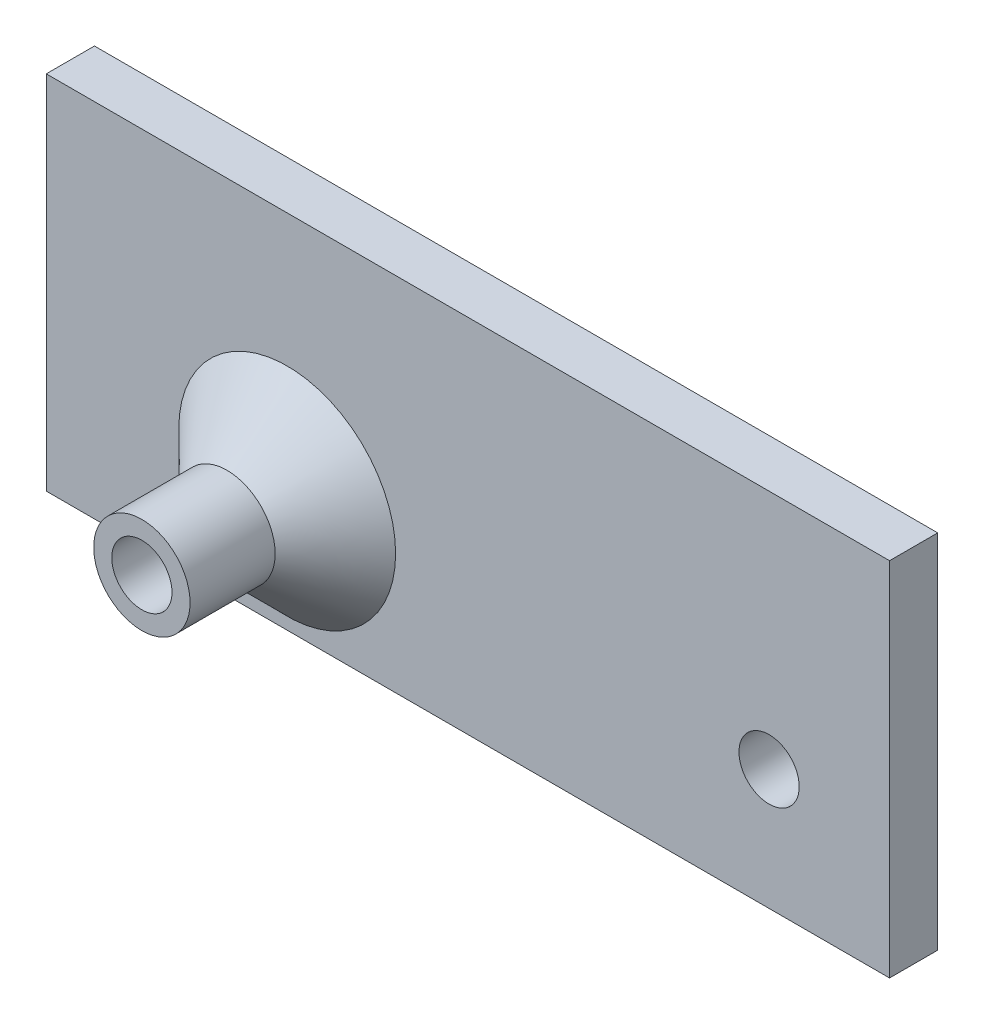
ISO-10303-21;
HEADER;
FILE_DESCRIPTION(('STEP AP214'),'2;1');
FILE_NAME('part.step','',(''),(''),'','','');
FILE_SCHEMA(('AUTOMOTIVE_DESIGN { 1 0 10303 214 1 1 1 1 }'));
ENDSEC;
DATA;
#1=APPLICATION_CONTEXT('core data for automotive mechanical design processes');
#2=APPLICATION_PROTOCOL_DEFINITION('international standard','automotive_design',2000,#1);
#3=PRODUCT_CONTEXT('',#1,'mechanical');
#4=PRODUCT('Part','Part','',(#3));
#5=PRODUCT_RELATED_PRODUCT_CATEGORY('part','',(#4));
#6=PRODUCT_DEFINITION_FORMATION('','',#4);
#7=PRODUCT_DEFINITION_CONTEXT('part definition',#1,'design');
#8=PRODUCT_DEFINITION('design','',#6,#7);
#9=PRODUCT_DEFINITION_SHAPE('','',#8);
#10=(LENGTH_UNIT() NAMED_UNIT(*) SI_UNIT(.MILLI.,.METRE.));
#11=(NAMED_UNIT(*) PLANE_ANGLE_UNIT() SI_UNIT($,.RADIAN.));
#12=(NAMED_UNIT(*) SI_UNIT($,.STERADIAN.) SOLID_ANGLE_UNIT());
#13=UNCERTAINTY_MEASURE_WITH_UNIT(LENGTH_MEASURE(1.E-05),#10,'distance_accuracy_value','');
#14=(GEOMETRIC_REPRESENTATION_CONTEXT(3) GLOBAL_UNCERTAINTY_ASSIGNED_CONTEXT((#13)) GLOBAL_UNIT_ASSIGNED_CONTEXT((#10,
#11,#12)) REPRESENTATION_CONTEXT('',''));
#15=CARTESIAN_POINT('',(0.,0.,0.));
#16=DIRECTION('',(0.,0.,1.));
#17=DIRECTION('',(1.,0.,0.));
#18=AXIS2_PLACEMENT_3D('',#15,#16,#17);
#19=CARTESIAN_POINT('',(50.,0.,4.));
#20=DIRECTION('',(1.,0.,0.));
#21=DIRECTION('',(0.,0.,-1.));
#22=AXIS2_PLACEMENT_3D('',#19,#20,#21);
#23=PLANE('',#22);
#24=DIRECTION('',(0.,-1.,0.));
#25=VECTOR('',#24,1.);
#26=CARTESIAN_POINT('',(50.,0.,0.));
#27=LINE('',#26,#25);
#28=CARTESIAN_POINT('',(50.,20.,0.));
#29=VERTEX_POINT('',#28);
#30=CARTESIAN_POINT('',(50.,-10.,0.));
#31=VERTEX_POINT('',#30);
#32=EDGE_CURVE('E127',#29,#31,#27,.T.);
#33=ORIENTED_EDGE('',*,*,#32,.F.);
#34=DIRECTION('',(0.,0.,-1.));
#35=VECTOR('',#34,1.);
#36=CARTESIAN_POINT('',(50.,20.,4.));
#37=LINE('',#36,#35);
#38=CARTESIAN_POINT('',(50.,20.,4.));
#39=VERTEX_POINT('',#38);
#40=EDGE_CURVE('E89',#39,#29,#37,.T.);
#41=ORIENTED_EDGE('',*,*,#40,.F.);
#42=DIRECTION('',(0.,-1.,0.));
#43=VECTOR('',#42,1.);
#44=CARTESIAN_POINT('',(50.,0.,4.));
#45=LINE('',#44,#43);
#46=CARTESIAN_POINT('',(50.,-10.,4.));
#47=VERTEX_POINT('',#46);
#48=EDGE_CURVE('E113',#39,#47,#45,.T.);
#49=ORIENTED_EDGE('',*,*,#48,.T.);
#50=DIRECTION('',(0.,0.,-1.));
#51=VECTOR('',#50,1.);
#52=CARTESIAN_POINT('',(50.,-10.,4.));
#53=LINE('',#52,#51);
#54=EDGE_CURVE('E86',#47,#31,#53,.T.);
#55=ORIENTED_EDGE('',*,*,#54,.T.);
#56=EDGE_LOOP('',(#33,#41,#49,#55));
#57=FACE_BOUND('',#56,.T.);
#58=ADVANCED_FACE('F43',(#57),#23,.T.);
#59=CARTESIAN_POINT('',(0.,20.,4.));
#60=DIRECTION('',(0.,1.,0.));
#61=DIRECTION('',(0.,0.,1.));
#62=AXIS2_PLACEMENT_3D('',#59,#60,#61);
#63=PLANE('',#62);
#64=DIRECTION('',(1.,0.,0.));
#65=VECTOR('',#64,1.);
#66=CARTESIAN_POINT('',(0.,20.,0.));
#67=LINE('',#66,#65);
#68=CARTESIAN_POINT('',(-20.,20.,0.));
#69=VERTEX_POINT('',#68);
#70=EDGE_CURVE('E100',#69,#29,#67,.T.);
#71=ORIENTED_EDGE('',*,*,#70,.F.);
#72=DIRECTION('',(0.,0.,-1.));
#73=VECTOR('',#72,1.);
#74=CARTESIAN_POINT('',(-20.,20.,4.));
#75=LINE('',#74,#73);
#76=CARTESIAN_POINT('',(-20.,20.,4.));
#77=VERTEX_POINT('',#76);
#78=EDGE_CURVE('E94',#77,#69,#75,.T.);
#79=ORIENTED_EDGE('',*,*,#78,.F.);
#80=DIRECTION('',(1.,0.,0.));
#81=VECTOR('',#80,1.);
#82=CARTESIAN_POINT('',(0.,20.,4.));
#83=LINE('',#82,#81);
#84=EDGE_CURVE('E98',#77,#39,#83,.T.);
#85=ORIENTED_EDGE('',*,*,#84,.T.);
#86=ORIENTED_EDGE('',*,*,#40,.T.);
#87=EDGE_LOOP('',(#71,#79,#85,#86));
#88=FACE_BOUND('',#87,.T.);
#89=ADVANCED_FACE('F96',(#88),#63,.T.);
#90=CARTESIAN_POINT('',(-20.,0.,4.));
#91=DIRECTION('',(1.,0.,0.));
#92=DIRECTION('',(0.,0.,-1.));
#93=AXIS2_PLACEMENT_3D('',#90,#91,#92);
#94=PLANE('',#93);
#95=DIRECTION('',(0.,-1.,0.));
#96=VECTOR('',#95,1.);
#97=CARTESIAN_POINT('',(-20.,0.,0.));
#98=LINE('',#97,#96);
#99=CARTESIAN_POINT('',(-20.,-10.,0.));
#100=VERTEX_POINT('',#99);
#101=EDGE_CURVE('E133',#69,#100,#98,.T.);
#102=ORIENTED_EDGE('',*,*,#101,.T.);
#103=DIRECTION('',(0.,0.,-1.));
#104=VECTOR('',#103,1.);
#105=CARTESIAN_POINT('',(-20.,-10.,4.));
#106=LINE('',#105,#104);
#107=CARTESIAN_POINT('',(-20.,-10.,4.));
#108=VERTEX_POINT('',#107);
#109=EDGE_CURVE('E104',#108,#100,#106,.T.);
#110=ORIENTED_EDGE('',*,*,#109,.F.);
#111=DIRECTION('',(0.,-1.,0.));
#112=VECTOR('',#111,1.);
#113=CARTESIAN_POINT('',(-20.,0.,4.));
#114=LINE('',#113,#112);
#115=EDGE_CURVE('E107',#77,#108,#114,.T.);
#116=ORIENTED_EDGE('',*,*,#115,.F.);
#117=ORIENTED_EDGE('',*,*,#78,.T.);
#118=EDGE_LOOP('',(#102,#110,#116,#117));
#119=FACE_BOUND('',#118,.T.);
#120=ADVANCED_FACE('F108',(#119),#94,.F.);
#121=CARTESIAN_POINT('',(0.,-10.,4.));
#122=DIRECTION('',(0.,1.,0.));
#123=DIRECTION('',(0.,0.,1.));
#124=AXIS2_PLACEMENT_3D('',#121,#122,#123);
#125=PLANE('',#124);
#126=DIRECTION('',(1.,0.,0.));
#127=VECTOR('',#126,1.);
#128=CARTESIAN_POINT('',(0.,-10.,0.));
#129=LINE('',#128,#127);
#130=EDGE_CURVE('E79',#100,#31,#129,.T.);
#131=ORIENTED_EDGE('',*,*,#130,.T.);
#132=ORIENTED_EDGE('',*,*,#54,.F.);
#133=DIRECTION('',(1.,0.,0.));
#134=VECTOR('',#133,1.);
#135=CARTESIAN_POINT('',(0.,-10.,4.));
#136=LINE('',#135,#134);
#137=EDGE_CURVE('E62',#108,#47,#136,.T.);
#138=ORIENTED_EDGE('',*,*,#137,.F.);
#139=ORIENTED_EDGE('',*,*,#109,.T.);
#140=EDGE_LOOP('',(#131,#132,#138,#139));
#141=FACE_BOUND('',#140,.T.);
#142=ADVANCED_FACE('F170',(#141),#125,.F.);
#143=CARTESIAN_POINT('',(40.,0.,4.));
#144=DIRECTION('',(0.,0.,-1.));
#145=DIRECTION('',(-1.,0.,0.));
#146=AXIS2_PLACEMENT_3D('',#143,#144,#145);
#147=CYLINDRICAL_SURFACE('',#146,2.50000000000001);
#148=CARTESIAN_POINT('',(40.,0.,4.));
#149=DIRECTION('',(0.,0.,1.));
#150=DIRECTION('',(1.,0.,0.));
#151=AXIS2_PLACEMENT_3D('',#148,#149,#150);
#152=CIRCLE('',#151,2.50000000000001);
#153=CARTESIAN_POINT('',(42.5,0.,4.));
#154=VERTEX_POINT('',#153);
#155=EDGE_CURVE('E123',#154,#154,#152,.T.);
#156=ORIENTED_EDGE('',*,*,#155,.T.);
#157=EDGE_LOOP('',(#156));
#158=FACE_BOUND('',#157,.T.);
#159=CARTESIAN_POINT('',(40.,0.,0.));
#160=DIRECTION('',(0.,0.,1.));
#161=DIRECTION('',(1.,0.,0.));
#162=AXIS2_PLACEMENT_3D('',#159,#160,#161);
#163=CIRCLE('',#162,2.50000000000001);
#164=CARTESIAN_POINT('',(42.5,0.,0.));
#165=VERTEX_POINT('',#164);
#166=EDGE_CURVE('E117',#165,#165,#163,.T.);
#167=ORIENTED_EDGE('',*,*,#166,.F.);
#168=EDGE_LOOP('',(#167));
#169=FACE_BOUND('',#168,.T.);
#170=ADVANCED_FACE('F173',(#158,#169),#147,.F.);
#171=CARTESIAN_POINT('',(0.,0.,4.));
#172=DIRECTION('',(0.,0.,1.));
#173=DIRECTION('',(1.,0.,0.));
#174=AXIS2_PLACEMENT_3D('',#171,#172,#173);
#175=PLANE('',#174);
#176=CARTESIAN_POINT('',(0.,0.,4.));
#177=DIRECTION('',(0.,0.,1.));
#178=DIRECTION('',(1.,0.,0.));
#179=AXIS2_PLACEMENT_3D('',#176,#177,#178);
#180=CIRCLE('',#179,8.99999999999998);
#181=CARTESIAN_POINT('',(8.99999999999998,0.,4.));
#182=VERTEX_POINT('',#181);
#183=EDGE_CURVE('E11',#182,#182,#180,.F.);
#184=ORIENTED_EDGE('',*,*,#183,.T.);
#185=EDGE_LOOP('',(#184));
#186=FACE_BOUND('',#185,.T.);
#187=ORIENTED_EDGE('',*,*,#48,.F.);
#188=ORIENTED_EDGE('',*,*,#84,.F.);
#189=ORIENTED_EDGE('',*,*,#115,.T.);
#190=ORIENTED_EDGE('',*,*,#137,.T.);
#191=EDGE_LOOP('',(#187,#188,#189,#190));
#192=FACE_BOUND('',#191,.T.);
#193=ORIENTED_EDGE('',*,*,#155,.F.);
#194=EDGE_LOOP('',(#193));
#195=FACE_BOUND('',#194,.T.);
#196=ADVANCED_FACE('F111',(#186,#192,#195),#175,.T.);
#197=CARTESIAN_POINT('',(0.,0.,0.));
#198=DIRECTION('',(0.,0.,1.));
#199=DIRECTION('',(1.,0.,0.));
#200=AXIS2_PLACEMENT_3D('',#197,#198,#199);
#201=PLANE('',#200);
#202=ORIENTED_EDGE('',*,*,#32,.T.);
#203=ORIENTED_EDGE('',*,*,#130,.F.);
#204=ORIENTED_EDGE('',*,*,#101,.F.);
#205=ORIENTED_EDGE('',*,*,#70,.T.);
#206=EDGE_LOOP('',(#202,#203,#204,#205));
#207=FACE_BOUND('',#206,.T.);
#208=ORIENTED_EDGE('',*,*,#166,.T.);
#209=EDGE_LOOP('',(#208));
#210=FACE_BOUND('',#209,.T.);
#211=CARTESIAN_POINT('',(0.,0.,0.));
#212=DIRECTION('',(0.,0.,1.));
#213=DIRECTION('',(1.,0.,0.));
#214=AXIS2_PLACEMENT_3D('',#211,#212,#213);
#215=CIRCLE('',#214,2.5);
#216=CARTESIAN_POINT('',(2.5,0.,0.));
#217=VERTEX_POINT('',#216);
#218=EDGE_CURVE('E266',#217,#217,#215,.T.);
#219=ORIENTED_EDGE('',*,*,#218,.T.);
#220=EDGE_LOOP('',(#219));
#221=FACE_BOUND('',#220,.T.);
#222=ADVANCED_FACE('F178',(#207,#210,#221),#201,.F.);
#223=CARTESIAN_POINT('',(0.,0.,16.063));
#224=DIRECTION('',(0.,0.,-1.));
#225=DIRECTION('',(-1.,0.,0.));
#226=AXIS2_PLACEMENT_3D('',#223,#224,#225);
#227=CYLINDRICAL_SURFACE('',#226,2.5);
#228=CARTESIAN_POINT('',(0.,0.,16.063));
#229=DIRECTION('',(0.,0.,1.));
#230=DIRECTION('',(1.,0.,0.));
#231=AXIS2_PLACEMENT_3D('',#228,#229,#230);
#232=CIRCLE('',#231,2.5);
#233=CARTESIAN_POINT('',(2.5,0.,16.063));
#234=VERTEX_POINT('',#233);
#235=EDGE_CURVE('E263',#234,#234,#232,.T.);
#236=ORIENTED_EDGE('',*,*,#235,.T.);
#237=EDGE_LOOP('',(#236));
#238=FACE_BOUND('',#237,.T.);
#239=ORIENTED_EDGE('',*,*,#218,.F.);
#240=EDGE_LOOP('',(#239));
#241=FACE_BOUND('',#240,.T.);
#242=ADVANCED_FACE('F181',(#238,#241),#227,.F.);
#243=CARTESIAN_POINT('',(0.,0.,16.063));
#244=DIRECTION('',(0.,0.,-1.));
#245=DIRECTION('',(-1.,0.,0.));
#246=AXIS2_PLACEMENT_3D('',#243,#244,#245);
#247=CYLINDRICAL_SURFACE('',#246,4.);
#248=CARTESIAN_POINT('',(0.,0.,9.00000000000004));
#249=DIRECTION('',(0.,0.,1.));
#250=DIRECTION('',(1.,0.,0.));
#251=AXIS2_PLACEMENT_3D('',#248,#249,#250);
#252=CIRCLE('',#251,4.);
#253=CARTESIAN_POINT('',(4.,0.,9.00000000000004));
#254=VERTEX_POINT('',#253);
#255=EDGE_CURVE('E54',#254,#254,#252,.T.);
#256=ORIENTED_EDGE('',*,*,#255,.T.);
#257=EDGE_LOOP('',(#256));
#258=FACE_BOUND('',#257,.T.);
#259=CARTESIAN_POINT('',(0.,0.,16.063));
#260=DIRECTION('',(0.,0.,1.));
#261=DIRECTION('',(1.,0.,0.));
#262=AXIS2_PLACEMENT_3D('',#259,#260,#261);
#263=CIRCLE('',#262,4.);
#264=CARTESIAN_POINT('',(4.,0.,16.063));
#265=VERTEX_POINT('',#264);
#266=EDGE_CURVE('E130',#265,#265,#263,.T.);
#267=ORIENTED_EDGE('',*,*,#266,.F.);
#268=EDGE_LOOP('',(#267));
#269=FACE_BOUND('',#268,.T.);
#270=ADVANCED_FACE('F150',(#258,#269),#247,.T.);
#271=CARTESIAN_POINT('',(0.,0.,16.063));
#272=DIRECTION('',(0.,0.,1.));
#273=DIRECTION('',(1.,0.,0.));
#274=AXIS2_PLACEMENT_3D('',#271,#272,#273);
#275=PLANE('',#274);
#276=ORIENTED_EDGE('',*,*,#235,.F.);
#277=EDGE_LOOP('',(#276));
#278=FACE_BOUND('',#277,.T.);
#279=ORIENTED_EDGE('',*,*,#266,.T.);
#280=EDGE_LOOP('',(#279));
#281=FACE_BOUND('',#280,.T.);
#282=ADVANCED_FACE('F154',(#278,#281),#275,.T.);
#283=CARTESIAN_POINT('',(0.,0.,9.00000000000004));
#284=DIRECTION('',(0.,0.,-1.));
#285=DIRECTION('',(-1.,0.,0.));
#286=AXIS2_PLACEMENT_3D('',#283,#284,#285);
#287=CONICAL_SURFACE('',#286,4.,0.785398163397443);
#288=ORIENTED_EDGE('',*,*,#183,.F.);
#289=EDGE_LOOP('',(#288));
#290=FACE_BOUND('',#289,.T.);
#291=ORIENTED_EDGE('',*,*,#255,.F.);
#292=EDGE_LOOP('',(#291));
#293=FACE_BOUND('',#292,.T.);
#294=ADVANCED_FACE('F46',(#290,#293),#287,.T.);
#295=CLOSED_SHELL('',(#58,#89,#120,#142,#170,#196,#222,#242,#270,#282,#294));
#296=MANIFOLD_SOLID_BREP('B2',#295);
#297=ADVANCED_BREP_SHAPE_REPRESENTATION('',(#18,#296),#14);
#298=SHAPE_DEFINITION_REPRESENTATION(#9,#297);
ENDSEC;
END-ISO-10303-21;
